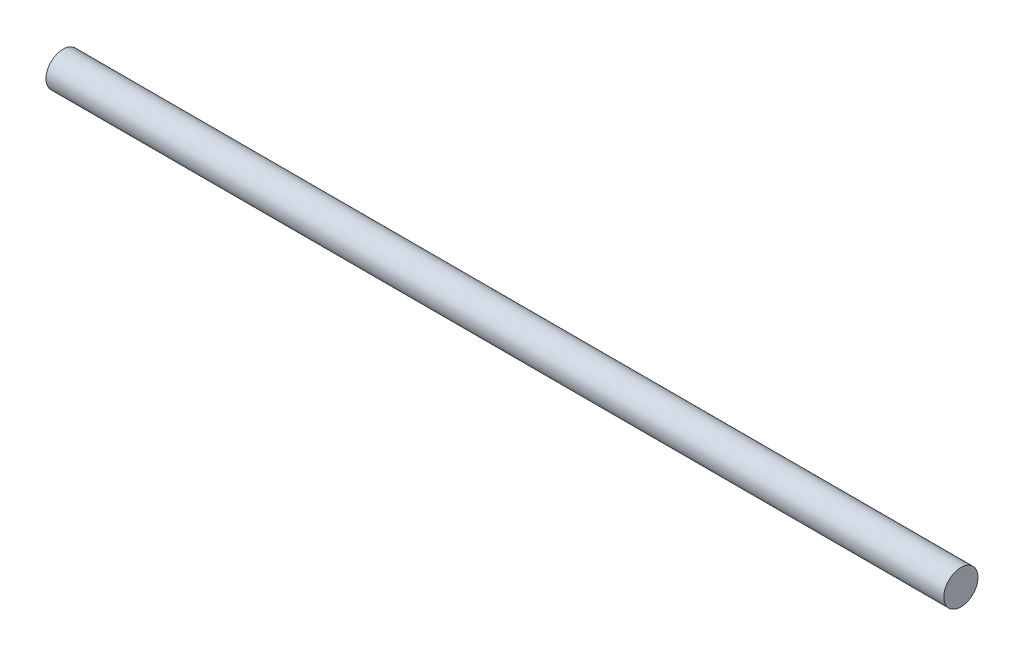
ISO-10303-21;
HEADER;
FILE_DESCRIPTION(('STEP AP214'),'2;1');
FILE_NAME('part.step','',(''),(''),'','','');
FILE_SCHEMA(('AUTOMOTIVE_DESIGN { 1 0 10303 214 1 1 1 1 }'));
ENDSEC;
DATA;
#1=APPLICATION_CONTEXT('core data for automotive mechanical design processes');
#2=APPLICATION_PROTOCOL_DEFINITION('international standard','automotive_design',2000,#1);
#3=PRODUCT_CONTEXT('',#1,'mechanical');
#4=PRODUCT('Part','Part','',(#3));
#5=PRODUCT_RELATED_PRODUCT_CATEGORY('part','',(#4));
#6=PRODUCT_DEFINITION_FORMATION('','',#4);
#7=PRODUCT_DEFINITION_CONTEXT('part definition',#1,'design');
#8=PRODUCT_DEFINITION('design','',#6,#7);
#9=PRODUCT_DEFINITION_SHAPE('','',#8);
#10=(LENGTH_UNIT() NAMED_UNIT(*) SI_UNIT(.MILLI.,.METRE.));
#11=(NAMED_UNIT(*) PLANE_ANGLE_UNIT() SI_UNIT($,.RADIAN.));
#12=(NAMED_UNIT(*) SI_UNIT($,.STERADIAN.) SOLID_ANGLE_UNIT());
#13=UNCERTAINTY_MEASURE_WITH_UNIT(LENGTH_MEASURE(1.E-05),#10,'distance_accuracy_value','');
#14=(GEOMETRIC_REPRESENTATION_CONTEXT(3) GLOBAL_UNCERTAINTY_ASSIGNED_CONTEXT((#13)) GLOBAL_UNIT_ASSIGNED_CONTEXT((#10,
#11,#12)) REPRESENTATION_CONTEXT('',''));
#15=CARTESIAN_POINT('',(0.,0.,0.));
#16=DIRECTION('',(0.,0.,1.));
#17=DIRECTION('',(1.,0.,0.));
#18=AXIS2_PLACEMENT_3D('',#15,#16,#17);
#19=CARTESIAN_POINT('',(250.,0.,0.));
#20=DIRECTION('',(-1.,0.,0.));
#21=DIRECTION('',(0.,0.,1.));
#22=AXIS2_PLACEMENT_3D('',#19,#20,#21);
#23=CYLINDRICAL_SURFACE('',#22,4.7625);
#24=CARTESIAN_POINT('',(250.,0.,0.));
#25=DIRECTION('',(1.,0.,0.));
#26=DIRECTION('',(0.,0.,-1.));
#27=AXIS2_PLACEMENT_3D('',#24,#25,#26);
#28=CIRCLE('',#27,4.7625);
#29=CARTESIAN_POINT('',(250.,0.,-4.7625));
#30=VERTEX_POINT('',#29);
#31=EDGE_CURVE('E10',#30,#30,#28,.T.);
#32=ORIENTED_EDGE('',*,*,#31,.F.);
#33=EDGE_LOOP('',(#32));
#34=FACE_BOUND('',#33,.T.);
#35=CARTESIAN_POINT('',(0.,0.,0.));
#36=DIRECTION('',(1.,0.,0.));
#37=DIRECTION('',(0.,0.,-1.));
#38=AXIS2_PLACEMENT_3D('',#35,#36,#37);
#39=CIRCLE('',#38,4.7625);
#40=CARTESIAN_POINT('',(0.,0.,-4.7625));
#41=VERTEX_POINT('',#40);
#42=EDGE_CURVE('E37',#41,#41,#39,.T.);
#43=ORIENTED_EDGE('',*,*,#42,.T.);
#44=EDGE_LOOP('',(#43));
#45=FACE_BOUND('',#44,.T.);
#46=ADVANCED_FACE('F34',(#34,#45),#23,.T.);
#47=CARTESIAN_POINT('',(250.,0.,0.));
#48=DIRECTION('',(1.,0.,0.));
#49=DIRECTION('',(0.,0.,-1.));
#50=AXIS2_PLACEMENT_3D('',#47,#48,#49);
#51=PLANE('',#50);
#52=ORIENTED_EDGE('',*,*,#31,.T.);
#53=EDGE_LOOP('',(#52));
#54=FACE_BOUND('',#53,.T.);
#55=ADVANCED_FACE('F49',(#54),#51,.T.);
#56=CARTESIAN_POINT('',(0.,0.,0.));
#57=DIRECTION('',(1.,0.,0.));
#58=DIRECTION('',(0.,0.,-1.));
#59=AXIS2_PLACEMENT_3D('',#56,#57,#58);
#60=PLANE('',#59);
#61=ORIENTED_EDGE('',*,*,#42,.F.);
#62=EDGE_LOOP('',(#61));
#63=FACE_BOUND('',#62,.T.);
#64=ADVANCED_FACE('F47',(#63),#60,.F.);
#65=CLOSED_SHELL('',(#46,#55,#64));
#66=MANIFOLD_SOLID_BREP('B2',#65);
#67=ADVANCED_BREP_SHAPE_REPRESENTATION('',(#18,#66),#14);
#68=SHAPE_DEFINITION_REPRESENTATION(#9,#67);
ENDSEC;
END-ISO-10303-21;
